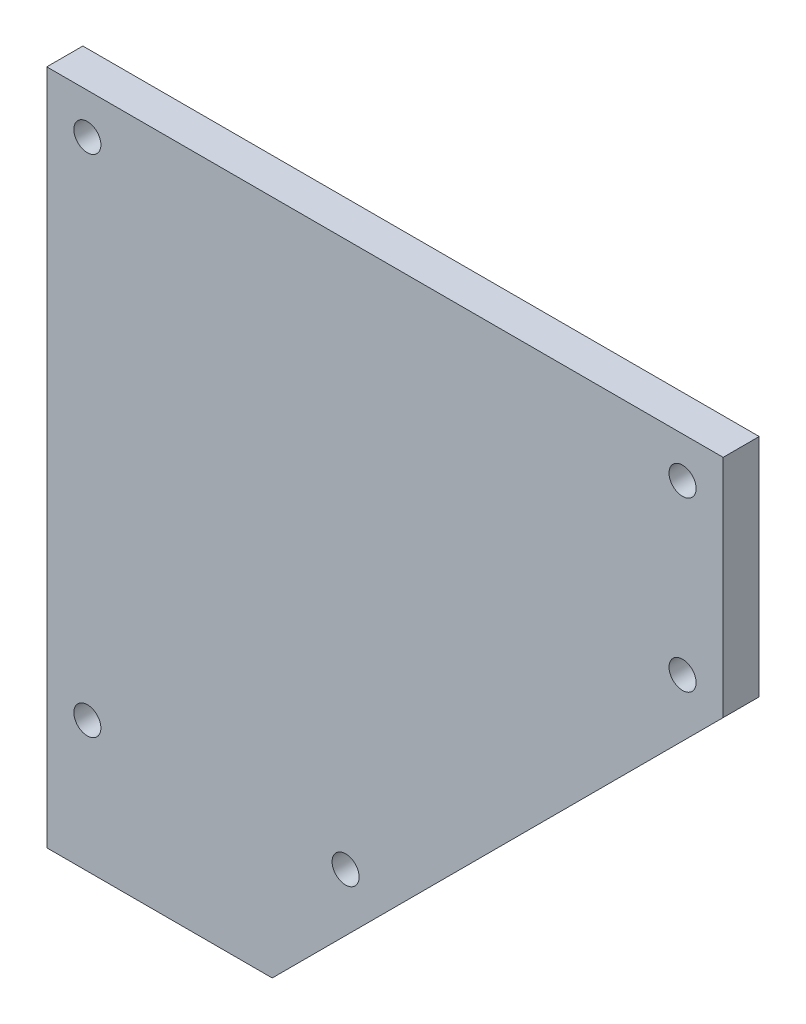
ISO-10303-21;
HEADER;
FILE_DESCRIPTION(('STEP AP214'),'2;1');
FILE_NAME('part.step','',(''),(''),'','','');
FILE_SCHEMA(('AUTOMOTIVE_DESIGN { 1 0 10303 214 1 1 1 1 }'));
ENDSEC;
DATA;
#1=APPLICATION_CONTEXT('core data for automotive mechanical design processes');
#2=APPLICATION_PROTOCOL_DEFINITION('international standard','automotive_design',2000,#1);
#3=PRODUCT_CONTEXT('',#1,'mechanical');
#4=PRODUCT('Part','Part','',(#3));
#5=PRODUCT_RELATED_PRODUCT_CATEGORY('part','',(#4));
#6=PRODUCT_DEFINITION_FORMATION('','',#4);
#7=PRODUCT_DEFINITION_CONTEXT('part definition',#1,'design');
#8=PRODUCT_DEFINITION('design','',#6,#7);
#9=PRODUCT_DEFINITION_SHAPE('','',#8);
#10=(LENGTH_UNIT() NAMED_UNIT(*) SI_UNIT(.MILLI.,.METRE.));
#11=(NAMED_UNIT(*) PLANE_ANGLE_UNIT() SI_UNIT($,.RADIAN.));
#12=(NAMED_UNIT(*) SI_UNIT($,.STERADIAN.) SOLID_ANGLE_UNIT());
#13=UNCERTAINTY_MEASURE_WITH_UNIT(LENGTH_MEASURE(1.E-05),#10,'distance_accuracy_value','');
#14=(GEOMETRIC_REPRESENTATION_CONTEXT(3) GLOBAL_UNCERTAINTY_ASSIGNED_CONTEXT((#13)) GLOBAL_UNIT_ASSIGNED_CONTEXT((#10,
#11,#12)) REPRESENTATION_CONTEXT('',''));
#15=CARTESIAN_POINT('',(0.,0.,0.));
#16=DIRECTION('',(0.,0.,1.));
#17=DIRECTION('',(1.,0.,0.));
#18=AXIS2_PLACEMENT_3D('',#15,#16,#17);
#19=CARTESIAN_POINT('',(0.,0.,4.));
#20=DIRECTION('',(0.,0.,1.));
#21=DIRECTION('',(1.,0.,0.));
#22=AXIS2_PLACEMENT_3D('',#19,#20,#21);
#23=PLANE('',#22);
#24=CARTESIAN_POINT('',(4.5,-60.5,4.));
#25=DIRECTION('',(0.,0.,1.));
#26=DIRECTION('',(1.,0.,0.));
#27=AXIS2_PLACEMENT_3D('',#24,#25,#26);
#28=CIRCLE('',#27,1.5);
#29=CARTESIAN_POINT('',(6.,-60.5,4.));
#30=VERTEX_POINT('',#29);
#31=EDGE_CURVE('E201',#30,#30,#28,.T.);
#32=ORIENTED_EDGE('',*,*,#31,.F.);
#33=EDGE_LOOP('',(#32));
#34=FACE_BOUND('',#33,.T.);
#35=CARTESIAN_POINT('',(70.4999999999998,-4.5,4.));
#36=DIRECTION('',(0.,0.,1.));
#37=DIRECTION('',(1.,0.,0.));
#38=AXIS2_PLACEMENT_3D('',#35,#36,#37);
#39=CIRCLE('',#38,1.5);
#40=CARTESIAN_POINT('',(71.9999999999998,-4.5,4.));
#41=VERTEX_POINT('',#40);
#42=EDGE_CURVE('E217',#41,#41,#39,.T.);
#43=ORIENTED_EDGE('',*,*,#42,.F.);
#44=EDGE_LOOP('',(#43));
#45=FACE_BOUND('',#44,.T.);
#46=DIRECTION('',(-1.,0.,0.));
#47=VECTOR('',#46,1.);
#48=CARTESIAN_POINT('',(74.9999999999998,0.,4.));
#49=LINE('',#48,#47);
#50=CARTESIAN_POINT('',(74.9999999999998,0.,4.));
#51=VERTEX_POINT('',#50);
#52=CARTESIAN_POINT('',(0.,0.,4.));
#53=VERTEX_POINT('',#52);
#54=EDGE_CURVE('E137',#51,#53,#49,.T.);
#55=ORIENTED_EDGE('',*,*,#54,.T.);
#56=DIRECTION('',(0.,-1.,0.));
#57=VECTOR('',#56,1.);
#58=CARTESIAN_POINT('',(0.,0.,4.));
#59=LINE('',#58,#57);
#60=CARTESIAN_POINT('',(0.,-75.,4.));
#61=VERTEX_POINT('',#60);
#62=EDGE_CURVE('E95',#53,#61,#59,.T.);
#63=ORIENTED_EDGE('',*,*,#62,.T.);
#64=DIRECTION('',(1.,0.,0.));
#65=VECTOR('',#64,1.);
#66=CARTESIAN_POINT('',(0.,-75.,4.));
#67=LINE('',#66,#65);
#68=CARTESIAN_POINT('',(25.,-75.,4.));
#69=VERTEX_POINT('',#68);
#70=EDGE_CURVE('E99',#61,#69,#67,.T.);
#71=ORIENTED_EDGE('',*,*,#70,.T.);
#72=DIRECTION('',(0.707106781186546,0.707106781186549,0.));
#73=VECTOR('',#72,1.);
#74=CARTESIAN_POINT('',(25.,-75.,4.));
#75=LINE('',#74,#73);
#76=CARTESIAN_POINT('',(74.9999999999998,-25.,4.));
#77=VERTEX_POINT('',#76);
#78=EDGE_CURVE('E103',#69,#77,#75,.T.);
#79=ORIENTED_EDGE('',*,*,#78,.T.);
#80=DIRECTION('',(0.,1.,0.));
#81=VECTOR('',#80,1.);
#82=CARTESIAN_POINT('',(74.9999999999998,-25.,4.));
#83=LINE('',#82,#81);
#84=EDGE_CURVE('E61',#77,#51,#83,.T.);
#85=ORIENTED_EDGE('',*,*,#84,.T.);
#86=EDGE_LOOP('',(#55,#63,#71,#79,#85));
#87=FACE_BOUND('',#86,.T.);
#88=CARTESIAN_POINT('',(4.5,-4.5,4.));
#89=DIRECTION('',(0.,0.,1.));
#90=DIRECTION('',(1.,0.,0.));
#91=AXIS2_PLACEMENT_3D('',#88,#89,#90);
#92=CIRCLE('',#91,1.5);
#93=CARTESIAN_POINT('',(6.,-4.5,4.));
#94=VERTEX_POINT('',#93);
#95=EDGE_CURVE('E128',#94,#94,#92,.T.);
#96=ORIENTED_EDGE('',*,*,#95,.F.);
#97=EDGE_LOOP('',(#96));
#98=FACE_BOUND('',#97,.T.);
#99=CARTESIAN_POINT('',(70.4999999999998,-23.1360389693213,4.));
#100=DIRECTION('',(0.,0.,1.));
#101=DIRECTION('',(1.,0.,0.));
#102=AXIS2_PLACEMENT_3D('',#99,#100,#101);
#103=CIRCLE('',#102,1.5);
#104=CARTESIAN_POINT('',(71.9999999999998,-23.1360389693213,4.));
#105=VERTEX_POINT('',#104);
#106=EDGE_CURVE('E209',#105,#105,#103,.T.);
#107=ORIENTED_EDGE('',*,*,#106,.F.);
#108=EDGE_LOOP('',(#107));
#109=FACE_BOUND('',#108,.T.);
#110=CARTESIAN_POINT('',(33.1360389693211,-60.5,4.));
#111=DIRECTION('',(0.,0.,1.));
#112=DIRECTION('',(1.,0.,0.));
#113=AXIS2_PLACEMENT_3D('',#110,#111,#112);
#114=CIRCLE('',#113,1.5);
#115=CARTESIAN_POINT('',(34.6360389693211,-60.5,4.));
#116=VERTEX_POINT('',#115);
#117=EDGE_CURVE('E190',#116,#116,#114,.T.);
#118=ORIENTED_EDGE('',*,*,#117,.F.);
#119=EDGE_LOOP('',(#118));
#120=FACE_BOUND('',#119,.T.);
#121=ADVANCED_FACE('F43',(#34,#45,#87,#98,#109,#120),#23,.T.);
#122=CARTESIAN_POINT('',(0.,0.,0.));
#123=DIRECTION('',(0.,0.,1.));
#124=DIRECTION('',(1.,0.,0.));
#125=AXIS2_PLACEMENT_3D('',#122,#123,#124);
#126=PLANE('',#125);
#127=DIRECTION('',(-1.,0.,0.));
#128=VECTOR('',#127,1.);
#129=CARTESIAN_POINT('',(74.9999999999998,0.,0.));
#130=LINE('',#129,#128);
#131=CARTESIAN_POINT('',(74.9999999999998,0.,0.));
#132=VERTEX_POINT('',#131);
#133=CARTESIAN_POINT('',(0.,0.,0.));
#134=VERTEX_POINT('',#133);
#135=EDGE_CURVE('E123',#132,#134,#130,.T.);
#136=ORIENTED_EDGE('',*,*,#135,.F.);
#137=DIRECTION('',(0.,1.,0.));
#138=VECTOR('',#137,1.);
#139=CARTESIAN_POINT('',(74.9999999999998,-25.,0.));
#140=LINE('',#139,#138);
#141=CARTESIAN_POINT('',(74.9999999999998,-25.,0.));
#142=VERTEX_POINT('',#141);
#143=EDGE_CURVE('E87',#142,#132,#140,.T.);
#144=ORIENTED_EDGE('',*,*,#143,.F.);
#145=DIRECTION('',(0.707106781186546,0.707106781186549,0.));
#146=VECTOR('',#145,1.);
#147=CARTESIAN_POINT('',(25.,-75.,0.));
#148=LINE('',#147,#146);
#149=CARTESIAN_POINT('',(25.,-75.,0.));
#150=VERTEX_POINT('',#149);
#151=EDGE_CURVE('E81',#150,#142,#148,.T.);
#152=ORIENTED_EDGE('',*,*,#151,.F.);
#153=DIRECTION('',(1.,0.,0.));
#154=VECTOR('',#153,1.);
#155=CARTESIAN_POINT('',(0.,-75.,0.));
#156=LINE('',#155,#154);
#157=CARTESIAN_POINT('',(0.,-75.,0.));
#158=VERTEX_POINT('',#157);
#159=EDGE_CURVE('E111',#158,#150,#156,.T.);
#160=ORIENTED_EDGE('',*,*,#159,.F.);
#161=DIRECTION('',(0.,-1.,0.));
#162=VECTOR('',#161,1.);
#163=CARTESIAN_POINT('',(0.,-65.,0.));
#164=LINE('',#163,#162);
#165=EDGE_CURVE('E127',#134,#158,#164,.T.);
#166=ORIENTED_EDGE('',*,*,#165,.F.);
#167=EDGE_LOOP('',(#136,#144,#152,#160,#166));
#168=FACE_BOUND('',#167,.T.);
#169=CARTESIAN_POINT('',(4.5,-4.5,0.));
#170=DIRECTION('',(0.,0.,1.));
#171=DIRECTION('',(1.,0.,0.));
#172=AXIS2_PLACEMENT_3D('',#169,#170,#171);
#173=CIRCLE('',#172,1.5);
#174=CARTESIAN_POINT('',(6.,-4.5,0.));
#175=VERTEX_POINT('',#174);
#176=EDGE_CURVE('E221',#175,#175,#173,.T.);
#177=ORIENTED_EDGE('',*,*,#176,.T.);
#178=EDGE_LOOP('',(#177));
#179=FACE_BOUND('',#178,.T.);
#180=CARTESIAN_POINT('',(70.4999999999998,-4.5,0.));
#181=DIRECTION('',(0.,0.,1.));
#182=DIRECTION('',(1.,0.,0.));
#183=AXIS2_PLACEMENT_3D('',#180,#181,#182);
#184=CIRCLE('',#183,1.5);
#185=CARTESIAN_POINT('',(71.9999999999998,-4.5,0.));
#186=VERTEX_POINT('',#185);
#187=EDGE_CURVE('E213',#186,#186,#184,.T.);
#188=ORIENTED_EDGE('',*,*,#187,.T.);
#189=EDGE_LOOP('',(#188));
#190=FACE_BOUND('',#189,.T.);
#191=CARTESIAN_POINT('',(70.4999999999998,-23.1360389693213,0.));
#192=DIRECTION('',(0.,0.,1.));
#193=DIRECTION('',(1.,0.,0.));
#194=AXIS2_PLACEMENT_3D('',#191,#192,#193);
#195=CIRCLE('',#194,1.5);
#196=CARTESIAN_POINT('',(71.9999999999998,-23.1360389693213,0.));
#197=VERTEX_POINT('',#196);
#198=EDGE_CURVE('E205',#197,#197,#195,.T.);
#199=ORIENTED_EDGE('',*,*,#198,.T.);
#200=EDGE_LOOP('',(#199));
#201=FACE_BOUND('',#200,.T.);
#202=CARTESIAN_POINT('',(4.5,-60.5,0.));
#203=DIRECTION('',(0.,0.,1.));
#204=DIRECTION('',(1.,0.,0.));
#205=AXIS2_PLACEMENT_3D('',#202,#203,#204);
#206=CIRCLE('',#205,1.5);
#207=CARTESIAN_POINT('',(6.,-60.5,0.));
#208=VERTEX_POINT('',#207);
#209=EDGE_CURVE('E198',#208,#208,#206,.T.);
#210=ORIENTED_EDGE('',*,*,#209,.T.);
#211=EDGE_LOOP('',(#210));
#212=FACE_BOUND('',#211,.T.);
#213=CARTESIAN_POINT('',(33.1360389693211,-60.5,0.));
#214=DIRECTION('',(0.,0.,1.));
#215=DIRECTION('',(1.,0.,0.));
#216=AXIS2_PLACEMENT_3D('',#213,#214,#215);
#217=CIRCLE('',#216,1.5);
#218=CARTESIAN_POINT('',(34.6360389693211,-60.5,0.));
#219=VERTEX_POINT('',#218);
#220=EDGE_CURVE('E193',#219,#219,#217,.T.);
#221=ORIENTED_EDGE('',*,*,#220,.T.);
#222=EDGE_LOOP('',(#221));
#223=FACE_BOUND('',#222,.T.);
#224=ADVANCED_FACE('F144',(#168,#179,#190,#201,#212,#223),#126,.F.);
#225=CARTESIAN_POINT('',(74.9999999999998,0.,4.));
#226=DIRECTION('',(0.,-1.,0.));
#227=DIRECTION('',(1.,0.,0.));
#228=AXIS2_PLACEMENT_3D('',#225,#226,#227);
#229=PLANE('',#228);
#230=ORIENTED_EDGE('',*,*,#135,.T.);
#231=DIRECTION('',(0.,0.,-1.));
#232=VECTOR('',#231,1.);
#233=CARTESIAN_POINT('',(0.,0.,4.));
#234=LINE('',#233,#232);
#235=EDGE_CURVE('E11',#53,#134,#234,.T.);
#236=ORIENTED_EDGE('',*,*,#235,.F.);
#237=ORIENTED_EDGE('',*,*,#54,.F.);
#238=DIRECTION('',(0.,0.,-1.));
#239=VECTOR('',#238,1.);
#240=CARTESIAN_POINT('',(74.9999999999998,0.,4.));
#241=LINE('',#240,#239);
#242=EDGE_CURVE('E119',#51,#132,#241,.T.);
#243=ORIENTED_EDGE('',*,*,#242,.T.);
#244=EDGE_LOOP('',(#230,#236,#237,#243));
#245=FACE_BOUND('',#244,.T.);
#246=ADVANCED_FACE('F45',(#245),#229,.F.);
#247=CARTESIAN_POINT('',(0.,-65.,4.));
#248=DIRECTION('',(1.,0.,0.));
#249=DIRECTION('',(0.,1.,0.));
#250=AXIS2_PLACEMENT_3D('',#247,#248,#249);
#251=PLANE('',#250);
#252=ORIENTED_EDGE('',*,*,#165,.T.);
#253=DIRECTION('',(0.,0.,-1.));
#254=VECTOR('',#253,1.);
#255=CARTESIAN_POINT('',(0.,-75.,4.));
#256=LINE('',#255,#254);
#257=EDGE_CURVE('E53',#61,#158,#256,.T.);
#258=ORIENTED_EDGE('',*,*,#257,.F.);
#259=ORIENTED_EDGE('',*,*,#62,.F.);
#260=ORIENTED_EDGE('',*,*,#235,.T.);
#261=EDGE_LOOP('',(#252,#258,#259,#260));
#262=FACE_BOUND('',#261,.T.);
#263=ADVANCED_FACE('F287',(#262),#251,.F.);
#264=CARTESIAN_POINT('',(0.,-75.,4.));
#265=DIRECTION('',(0.,1.,0.));
#266=DIRECTION('',(0.,0.,1.));
#267=AXIS2_PLACEMENT_3D('',#264,#265,#266);
#268=PLANE('',#267);
#269=ORIENTED_EDGE('',*,*,#159,.T.);
#270=DIRECTION('',(0.,0.,-1.));
#271=VECTOR('',#270,1.);
#272=CARTESIAN_POINT('',(25.,-75.,4.));
#273=LINE('',#272,#271);
#274=EDGE_CURVE('E108',#69,#150,#273,.T.);
#275=ORIENTED_EDGE('',*,*,#274,.F.);
#276=ORIENTED_EDGE('',*,*,#70,.F.);
#277=ORIENTED_EDGE('',*,*,#257,.T.);
#278=EDGE_LOOP('',(#269,#275,#276,#277));
#279=FACE_BOUND('',#278,.T.);
#280=ADVANCED_FACE('F109',(#279),#268,.F.);
#281=CARTESIAN_POINT('',(25.,-75.,4.));
#282=DIRECTION('',(-0.707106781186549,0.707106781186546,0.));
#283=DIRECTION('',(-0.707106781186546,-0.707106781186549,0.));
#284=AXIS2_PLACEMENT_3D('',#281,#282,#283);
#285=PLANE('',#284);
#286=ORIENTED_EDGE('',*,*,#151,.T.);
#287=DIRECTION('',(0.,0.,-1.));
#288=VECTOR('',#287,1.);
#289=CARTESIAN_POINT('',(74.9999999999998,-25.,4.));
#290=LINE('',#289,#288);
#291=EDGE_CURVE('E113',#77,#142,#290,.T.);
#292=ORIENTED_EDGE('',*,*,#291,.F.);
#293=ORIENTED_EDGE('',*,*,#78,.F.);
#294=ORIENTED_EDGE('',*,*,#274,.T.);
#295=EDGE_LOOP('',(#286,#292,#293,#294));
#296=FACE_BOUND('',#295,.T.);
#297=ADVANCED_FACE('F115',(#296),#285,.F.);
#298=CARTESIAN_POINT('',(74.9999999999998,-25.,4.));
#299=DIRECTION('',(-1.,0.,0.));
#300=DIRECTION('',(0.,-1.,0.));
#301=AXIS2_PLACEMENT_3D('',#298,#299,#300);
#302=PLANE('',#301);
#303=ORIENTED_EDGE('',*,*,#143,.T.);
#304=ORIENTED_EDGE('',*,*,#242,.F.);
#305=ORIENTED_EDGE('',*,*,#84,.F.);
#306=ORIENTED_EDGE('',*,*,#291,.T.);
#307=EDGE_LOOP('',(#303,#304,#305,#306));
#308=FACE_BOUND('',#307,.T.);
#309=ADVANCED_FACE('F149',(#308),#302,.F.);
#310=CARTESIAN_POINT('',(4.5,-4.5,4.));
#311=DIRECTION('',(0.,0.,-1.));
#312=DIRECTION('',(-1.,0.,0.));
#313=AXIS2_PLACEMENT_3D('',#310,#311,#312);
#314=CYLINDRICAL_SURFACE('',#313,1.5);
#315=ORIENTED_EDGE('',*,*,#95,.T.);
#316=EDGE_LOOP('',(#315));
#317=FACE_BOUND('',#316,.T.);
#318=ORIENTED_EDGE('',*,*,#176,.F.);
#319=EDGE_LOOP('',(#318));
#320=FACE_BOUND('',#319,.T.);
#321=ADVANCED_FACE('F151',(#317,#320),#314,.F.);
#322=CARTESIAN_POINT('',(70.4999999999998,-4.5,4.));
#323=DIRECTION('',(0.,0.,-1.));
#324=DIRECTION('',(-1.,0.,0.));
#325=AXIS2_PLACEMENT_3D('',#322,#323,#324);
#326=CYLINDRICAL_SURFACE('',#325,1.5);
#327=ORIENTED_EDGE('',*,*,#42,.T.);
#328=EDGE_LOOP('',(#327));
#329=FACE_BOUND('',#328,.T.);
#330=ORIENTED_EDGE('',*,*,#187,.F.);
#331=EDGE_LOOP('',(#330));
#332=FACE_BOUND('',#331,.T.);
#333=ADVANCED_FACE('F157',(#329,#332),#326,.F.);
#334=CARTESIAN_POINT('',(70.4999999999998,-23.1360389693213,4.));
#335=DIRECTION('',(0.,0.,-1.));
#336=DIRECTION('',(-1.,0.,0.));
#337=AXIS2_PLACEMENT_3D('',#334,#335,#336);
#338=CYLINDRICAL_SURFACE('',#337,1.5);
#339=ORIENTED_EDGE('',*,*,#106,.T.);
#340=EDGE_LOOP('',(#339));
#341=FACE_BOUND('',#340,.T.);
#342=ORIENTED_EDGE('',*,*,#198,.F.);
#343=EDGE_LOOP('',(#342));
#344=FACE_BOUND('',#343,.T.);
#345=ADVANCED_FACE('F173',(#341,#344),#338,.F.);
#346=CARTESIAN_POINT('',(4.5,-60.5,4.));
#347=DIRECTION('',(0.,0.,-1.));
#348=DIRECTION('',(-1.,0.,0.));
#349=AXIS2_PLACEMENT_3D('',#346,#347,#348);
#350=CYLINDRICAL_SURFACE('',#349,1.5);
#351=ORIENTED_EDGE('',*,*,#31,.T.);
#352=EDGE_LOOP('',(#351));
#353=FACE_BOUND('',#352,.T.);
#354=ORIENTED_EDGE('',*,*,#209,.F.);
#355=EDGE_LOOP('',(#354));
#356=FACE_BOUND('',#355,.T.);
#357=ADVANCED_FACE('F177',(#353,#356),#350,.F.);
#358=CARTESIAN_POINT('',(33.1360389693211,-60.5,4.));
#359=DIRECTION('',(0.,0.,-1.));
#360=DIRECTION('',(-1.,0.,0.));
#361=AXIS2_PLACEMENT_3D('',#358,#359,#360);
#362=CYLINDRICAL_SURFACE('',#361,1.5);
#363=ORIENTED_EDGE('',*,*,#117,.T.);
#364=EDGE_LOOP('',(#363));
#365=FACE_BOUND('',#364,.T.);
#366=ORIENTED_EDGE('',*,*,#220,.F.);
#367=EDGE_LOOP('',(#366));
#368=FACE_BOUND('',#367,.T.);
#369=ADVANCED_FACE('F181',(#365,#368),#362,.F.);
#370=CLOSED_SHELL('',(#121,#224,#246,#263,#280,#297,#309,#321,#333,#345,#357,#369));
#371=MANIFOLD_SOLID_BREP('B2',#370);
#372=ADVANCED_BREP_SHAPE_REPRESENTATION('',(#18,#371),#14);
#373=SHAPE_DEFINITION_REPRESENTATION(#9,#372);
ENDSEC;
END-ISO-10303-21;
